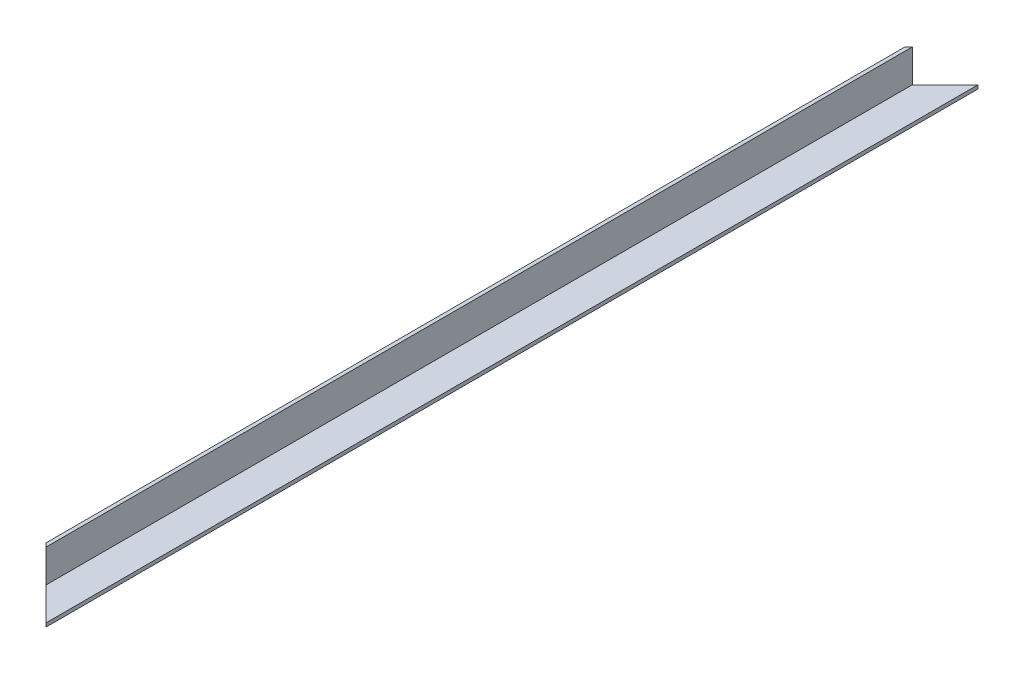
ISO-10303-21;
HEADER;
FILE_DESCRIPTION(('STEP AP214'),'2;1');
FILE_NAME('part.step','',(''),(''),'','','');
FILE_SCHEMA(('AUTOMOTIVE_DESIGN { 1 0 10303 214 1 1 1 1 }'));
ENDSEC;
DATA;
#1=APPLICATION_CONTEXT('core data for automotive mechanical design processes');
#2=APPLICATION_PROTOCOL_DEFINITION('international standard','automotive_design',2000,#1);
#3=PRODUCT_CONTEXT('',#1,'mechanical');
#4=PRODUCT('Part','Part','',(#3));
#5=PRODUCT_RELATED_PRODUCT_CATEGORY('part','',(#4));
#6=PRODUCT_DEFINITION_FORMATION('','',#4);
#7=PRODUCT_DEFINITION_CONTEXT('part definition',#1,'design');
#8=PRODUCT_DEFINITION('design','',#6,#7);
#9=PRODUCT_DEFINITION_SHAPE('','',#8);
#10=(LENGTH_UNIT() NAMED_UNIT(*) SI_UNIT(.MILLI.,.METRE.));
#11=(NAMED_UNIT(*) PLANE_ANGLE_UNIT() SI_UNIT($,.RADIAN.));
#12=(NAMED_UNIT(*) SI_UNIT($,.STERADIAN.) SOLID_ANGLE_UNIT());
#13=UNCERTAINTY_MEASURE_WITH_UNIT(LENGTH_MEASURE(1.E-05),#10,'distance_accuracy_value','');
#14=(GEOMETRIC_REPRESENTATION_CONTEXT(3) GLOBAL_UNCERTAINTY_ASSIGNED_CONTEXT((#13)) GLOBAL_UNIT_ASSIGNED_CONTEXT((#10,
#11,#12)) REPRESENTATION_CONTEXT('',''));
#15=CARTESIAN_POINT('',(0.,0.,0.));
#16=DIRECTION('',(0.,0.,1.));
#17=DIRECTION('',(1.,0.,0.));
#18=AXIS2_PLACEMENT_3D('',#15,#16,#17);
#19=CARTESIAN_POINT('',(0.,20.,511.));
#20=DIRECTION('',(1.,0.,0.));
#21=DIRECTION('',(0.,1.,0.));
#22=AXIS2_PLACEMENT_3D('',#19,#20,#21);
#23=PLANE('',#22);
#24=DIRECTION('',(0.,-1.,0.));
#25=VECTOR('',#24,1.);
#26=CARTESIAN_POINT('',(0.,25.,491.));
#27=LINE('',#26,#25);
#28=CARTESIAN_POINT('',(0.,20.,491.));
#29=VERTEX_POINT('',#28);
#30=CARTESIAN_POINT('',(0.,0.,491.));
#31=VERTEX_POINT('',#30);
#32=EDGE_CURVE('E137',#29,#31,#27,.T.);
#33=ORIENTED_EDGE('',*,*,#32,.F.);
#34=DIRECTION('',(0.,0.,-1.));
#35=VECTOR('',#34,1.);
#36=CARTESIAN_POINT('',(0.,20.,511.));
#37=LINE('',#36,#35);
#38=CARTESIAN_POINT('',(0.,20.,20.0000000000002));
#39=VERTEX_POINT('',#38);
#40=EDGE_CURVE('E121',#29,#39,#37,.T.);
#41=ORIENTED_EDGE('',*,*,#40,.T.);
#42=DIRECTION('',(0.,-1.,0.));
#43=VECTOR('',#42,1.);
#44=CARTESIAN_POINT('',(0.,25.,20.0000000000002));
#45=LINE('',#44,#43);
#46=CARTESIAN_POINT('',(0.,0.,20.0000000000002));
#47=VERTEX_POINT('',#46);
#48=EDGE_CURVE('E138',#39,#47,#45,.T.);
#49=ORIENTED_EDGE('',*,*,#48,.T.);
#50=DIRECTION('',(0.,0.,-1.));
#51=VECTOR('',#50,1.);
#52=CARTESIAN_POINT('',(0.,0.,511.));
#53=LINE('',#52,#51);
#54=EDGE_CURVE('E11',#31,#47,#53,.T.);
#55=ORIENTED_EDGE('',*,*,#54,.F.);
#56=EDGE_LOOP('',(#33,#41,#49,#55));
#57=FACE_BOUND('',#56,.T.);
#58=ADVANCED_FACE('F40',(#57),#23,.F.);
#59=CARTESIAN_POINT('',(0.,0.,511.));
#60=DIRECTION('',(0.,1.,0.));
#61=DIRECTION('',(0.,0.,1.));
#62=AXIS2_PLACEMENT_3D('',#59,#60,#61);
#63=PLANE('',#62);
#64=DIRECTION('',(0.707106781186551,0.,0.707106781186544));
#65=VECTOR('',#64,1.);
#66=CARTESIAN_POINT('',(9.9999999999999,0.,501.));
#67=LINE('',#66,#65);
#68=CARTESIAN_POINT('',(20.,0.,511.));
#69=VERTEX_POINT('',#68);
#70=EDGE_CURVE('E55',#31,#69,#67,.T.);
#71=ORIENTED_EDGE('',*,*,#70,.F.);
#72=ORIENTED_EDGE('',*,*,#54,.T.);
#73=DIRECTION('',(-0.707106781186544,0.,0.707106781186551));
#74=VECTOR('',#73,1.);
#75=CARTESIAN_POINT('',(-245.5,0.,265.500000000002));
#76=LINE('',#75,#74);
#77=CARTESIAN_POINT('',(20.,0.,0.));
#78=VERTEX_POINT('',#77);
#79=EDGE_CURVE('E91',#78,#47,#76,.T.);
#80=ORIENTED_EDGE('',*,*,#79,.F.);
#81=DIRECTION('',(0.,0.,-1.));
#82=VECTOR('',#81,1.);
#83=CARTESIAN_POINT('',(20.,0.,511.));
#84=LINE('',#83,#82);
#85=EDGE_CURVE('E49',#69,#78,#84,.T.);
#86=ORIENTED_EDGE('',*,*,#85,.F.);
#87=EDGE_LOOP('',(#71,#72,#80,#86));
#88=FACE_BOUND('',#87,.T.);
#89=ADVANCED_FACE('F102',(#88),#63,.F.);
#90=CARTESIAN_POINT('',(2.,2.,511.));
#91=DIRECTION('',(0.,-1.,0.));
#92=DIRECTION('',(0.,0.,-1.));
#93=AXIS2_PLACEMENT_3D('',#90,#91,#92);
#94=PLANE('',#93);
#95=DIRECTION('',(-0.707106781186551,0.,-0.707106781186544));
#96=VECTOR('',#95,1.);
#97=CARTESIAN_POINT('',(10.9999999999999,2.,502.));
#98=LINE('',#97,#96);
#99=CARTESIAN_POINT('',(20.,2.,511.));
#100=VERTEX_POINT('',#99);
#101=CARTESIAN_POINT('',(2.,2.,493.));
#102=VERTEX_POINT('',#101);
#103=EDGE_CURVE('E127',#100,#102,#98,.T.);
#104=ORIENTED_EDGE('',*,*,#103,.F.);
#105=DIRECTION('',(0.,0.,-1.));
#106=VECTOR('',#105,1.);
#107=CARTESIAN_POINT('',(20.,2.,511.));
#108=LINE('',#107,#106);
#109=CARTESIAN_POINT('',(20.,2.,0.));
#110=VERTEX_POINT('',#109);
#111=EDGE_CURVE('E109',#100,#110,#108,.T.);
#112=ORIENTED_EDGE('',*,*,#111,.T.);
#113=DIRECTION('',(0.707106781186544,0.,-0.707106781186551));
#114=VECTOR('',#113,1.);
#115=CARTESIAN_POINT('',(-244.5,2.,264.500000000002));
#116=LINE('',#115,#114);
#117=CARTESIAN_POINT('',(2.,2.,18.0000000000002));
#118=VERTEX_POINT('',#117);
#119=EDGE_CURVE('E94',#118,#110,#116,.T.);
#120=ORIENTED_EDGE('',*,*,#119,.F.);
#121=DIRECTION('',(0.,0.,-1.));
#122=VECTOR('',#121,1.);
#123=CARTESIAN_POINT('',(2.,2.,511.));
#124=LINE('',#123,#122);
#125=EDGE_CURVE('E112',#102,#118,#124,.T.);
#126=ORIENTED_EDGE('',*,*,#125,.F.);
#127=EDGE_LOOP('',(#104,#112,#120,#126));
#128=FACE_BOUND('',#127,.T.);
#129=ADVANCED_FACE('F156',(#128),#94,.F.);
#130=CARTESIAN_POINT('',(2.,20.,511.));
#131=DIRECTION('',(-1.,0.,0.));
#132=DIRECTION('',(0.,-1.,0.));
#133=AXIS2_PLACEMENT_3D('',#130,#131,#132);
#134=PLANE('',#133);
#135=DIRECTION('',(0.,1.,0.));
#136=VECTOR('',#135,1.);
#137=CARTESIAN_POINT('',(2.,20.,493.));
#138=LINE('',#137,#136);
#139=CARTESIAN_POINT('',(2.,20.,493.));
#140=VERTEX_POINT('',#139);
#141=EDGE_CURVE('E129',#102,#140,#138,.T.);
#142=ORIENTED_EDGE('',*,*,#141,.F.);
#143=ORIENTED_EDGE('',*,*,#125,.T.);
#144=DIRECTION('',(0.,-1.,0.));
#145=VECTOR('',#144,1.);
#146=CARTESIAN_POINT('',(2.,20.0000000000001,18.0000000000002));
#147=LINE('',#146,#145);
#148=CARTESIAN_POINT('',(2.,20.,18.0000000000002));
#149=VERTEX_POINT('',#148);
#150=EDGE_CURVE('E133',#149,#118,#147,.T.);
#151=ORIENTED_EDGE('',*,*,#150,.F.);
#152=DIRECTION('',(0.,0.,-1.));
#153=VECTOR('',#152,1.);
#154=CARTESIAN_POINT('',(2.,20.,511.));
#155=LINE('',#154,#153);
#156=EDGE_CURVE('E118',#140,#149,#155,.T.);
#157=ORIENTED_EDGE('',*,*,#156,.F.);
#158=EDGE_LOOP('',(#142,#143,#151,#157));
#159=FACE_BOUND('',#158,.T.);
#160=ADVANCED_FACE('F152',(#159),#134,.F.);
#161=CARTESIAN_POINT('',(2.,20.,511.));
#162=DIRECTION('',(0.,-1.,0.));
#163=DIRECTION('',(0.,0.,-1.));
#164=AXIS2_PLACEMENT_3D('',#161,#162,#163);
#165=PLANE('',#164);
#166=DIRECTION('',(-0.707106781186551,0.,-0.707106781186544));
#167=VECTOR('',#166,1.);
#168=CARTESIAN_POINT('',(10.9999999999999,20.,502.));
#169=LINE('',#168,#167);
#170=EDGE_CURVE('E105',#140,#29,#169,.T.);
#171=ORIENTED_EDGE('',*,*,#170,.F.);
#172=ORIENTED_EDGE('',*,*,#156,.T.);
#173=DIRECTION('',(0.707106781186544,0.,-0.707106781186551));
#174=VECTOR('',#173,1.);
#175=CARTESIAN_POINT('',(-244.5,20.,264.500000000002));
#176=LINE('',#175,#174);
#177=EDGE_CURVE('E135',#39,#149,#176,.T.);
#178=ORIENTED_EDGE('',*,*,#177,.F.);
#179=ORIENTED_EDGE('',*,*,#40,.F.);
#180=EDGE_LOOP('',(#171,#172,#178,#179));
#181=FACE_BOUND('',#180,.T.);
#182=ADVANCED_FACE('F148',(#181),#165,.F.);
#183=CARTESIAN_POINT('',(20.,2.,511.));
#184=DIRECTION('',(-1.,0.,0.));
#185=DIRECTION('',(0.,0.,1.));
#186=AXIS2_PLACEMENT_3D('',#183,#184,#185);
#187=PLANE('',#186);
#188=DIRECTION('',(0.,1.,0.));
#189=VECTOR('',#188,1.);
#190=CARTESIAN_POINT('',(20.,2.,0.));
#191=LINE('',#190,#189);
#192=EDGE_CURVE('E88',#78,#110,#191,.T.);
#193=ORIENTED_EDGE('',*,*,#192,.T.);
#194=ORIENTED_EDGE('',*,*,#111,.F.);
#195=DIRECTION('',(0.,1.,0.));
#196=VECTOR('',#195,1.);
#197=CARTESIAN_POINT('',(20.,2.,511.));
#198=LINE('',#197,#196);
#199=EDGE_CURVE('E99',#69,#100,#198,.T.);
#200=ORIENTED_EDGE('',*,*,#199,.F.);
#201=ORIENTED_EDGE('',*,*,#85,.T.);
#202=EDGE_LOOP('',(#193,#194,#200,#201));
#203=FACE_BOUND('',#202,.T.);
#204=ADVANCED_FACE('F107',(#203),#187,.F.);
#205=CARTESIAN_POINT('',(20.,25.,0.));
#206=DIRECTION('',(-0.707106781186551,0.,-0.707106781186544));
#207=DIRECTION('',(-0.707106781186544,0.,0.707106781186551));
#208=AXIS2_PLACEMENT_3D('',#205,#206,#207);
#209=PLANE('',#208);
#210=ORIENTED_EDGE('',*,*,#79,.T.);
#211=ORIENTED_EDGE('',*,*,#48,.F.);
#212=ORIENTED_EDGE('',*,*,#177,.T.);
#213=ORIENTED_EDGE('',*,*,#150,.T.);
#214=ORIENTED_EDGE('',*,*,#119,.T.);
#215=ORIENTED_EDGE('',*,*,#192,.F.);
#216=EDGE_LOOP('',(#210,#211,#212,#213,#214,#215));
#217=FACE_BOUND('',#216,.T.);
#218=ADVANCED_FACE('F90',(#217),#209,.T.);
#219=CARTESIAN_POINT('',(20.,25.,511.));
#220=DIRECTION('',(-0.707106781186544,0.,0.707106781186551));
#221=DIRECTION('',(0.707106781186551,0.,0.707106781186544));
#222=AXIS2_PLACEMENT_3D('',#219,#220,#221);
#223=PLANE('',#222);
#224=ORIENTED_EDGE('',*,*,#70,.T.);
#225=ORIENTED_EDGE('',*,*,#199,.T.);
#226=ORIENTED_EDGE('',*,*,#103,.T.);
#227=ORIENTED_EDGE('',*,*,#141,.T.);
#228=ORIENTED_EDGE('',*,*,#170,.T.);
#229=ORIENTED_EDGE('',*,*,#32,.T.);
#230=EDGE_LOOP('',(#224,#225,#226,#227,#228,#229));
#231=FACE_BOUND('',#230,.T.);
#232=ADVANCED_FACE('F141',(#231),#223,.T.);
#233=CLOSED_SHELL('',(#58,#89,#129,#160,#182,#204,#218,#232));
#234=MANIFOLD_SOLID_BREP('B2',#233);
#235=ADVANCED_BREP_SHAPE_REPRESENTATION('',(#18,#234),#14);
#236=SHAPE_DEFINITION_REPRESENTATION(#9,#235);
ENDSEC;
END-ISO-10303-21;
